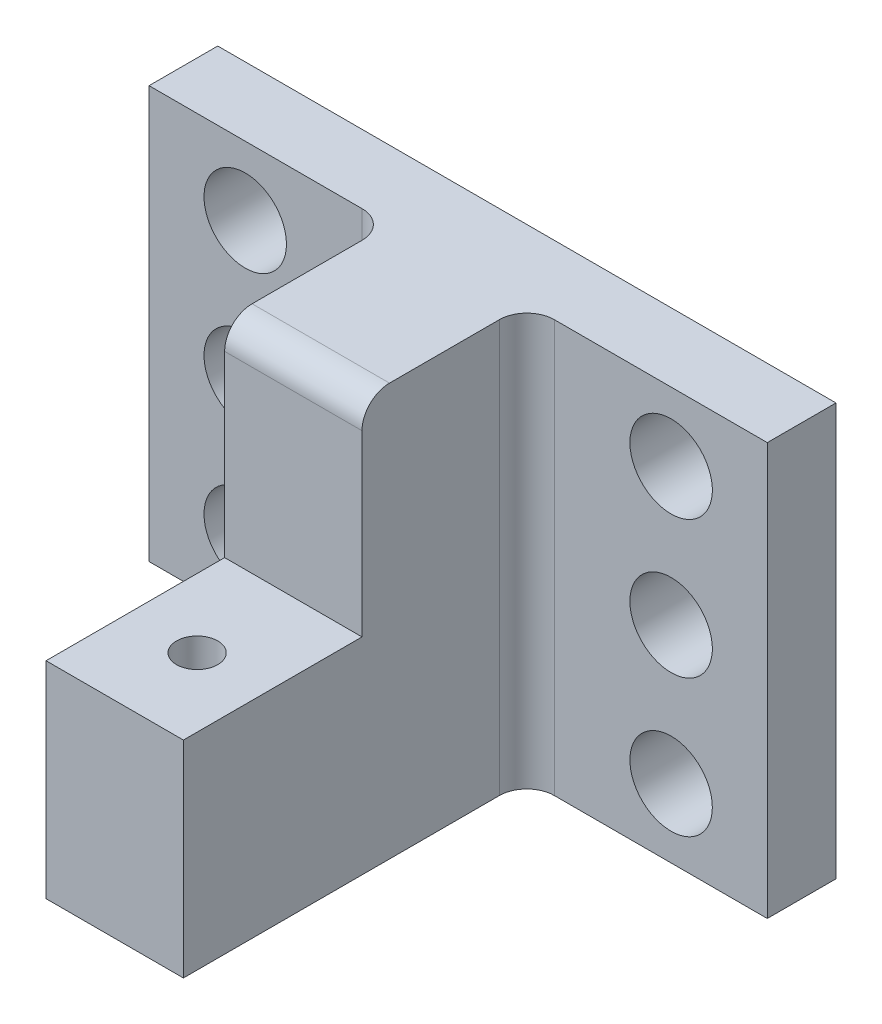
ISO-10303-21;
HEADER;
FILE_DESCRIPTION(('STEP AP214'),'2;1');
FILE_NAME('part.step','',(''),(''),'','','');
FILE_SCHEMA(('AUTOMOTIVE_DESIGN { 1 0 10303 214 1 1 1 1 }'));
ENDSEC;
DATA;
#1=APPLICATION_CONTEXT('core data for automotive mechanical design processes');
#2=APPLICATION_PROTOCOL_DEFINITION('international standard','automotive_design',2000,#1);
#3=PRODUCT_CONTEXT('',#1,'mechanical');
#4=PRODUCT('Part','Part','',(#3));
#5=PRODUCT_RELATED_PRODUCT_CATEGORY('part','',(#4));
#6=PRODUCT_DEFINITION_FORMATION('','',#4);
#7=PRODUCT_DEFINITION_CONTEXT('part definition',#1,'design');
#8=PRODUCT_DEFINITION('design','',#6,#7);
#9=PRODUCT_DEFINITION_SHAPE('','',#8);
#10=(LENGTH_UNIT() NAMED_UNIT(*) SI_UNIT(.MILLI.,.METRE.));
#11=(NAMED_UNIT(*) PLANE_ANGLE_UNIT() SI_UNIT($,.RADIAN.));
#12=(NAMED_UNIT(*) SI_UNIT($,.STERADIAN.) SOLID_ANGLE_UNIT());
#13=UNCERTAINTY_MEASURE_WITH_UNIT(LENGTH_MEASURE(1.E-05),#10,'distance_accuracy_value','');
#14=(GEOMETRIC_REPRESENTATION_CONTEXT(3) GLOBAL_UNCERTAINTY_ASSIGNED_CONTEXT((#13)) GLOBAL_UNIT_ASSIGNED_CONTEXT((#10,
#11,#12)) REPRESENTATION_CONTEXT('',''));
#15=CARTESIAN_POINT('',(0.,0.,0.));
#16=DIRECTION('',(0.,0.,1.));
#17=DIRECTION('',(1.,0.,0.));
#18=AXIS2_PLACEMENT_3D('',#15,#16,#17);
#19=CARTESIAN_POINT('',(7.,15.,7.));
#20=DIRECTION('',(0.,1.,0.));
#21=DIRECTION('',(-1.,0.,0.));
#22=AXIS2_PLACEMENT_3D('',#19,#20,#21);
#23=CYLINDRICAL_SURFACE('',#22,2.);
#24=DIRECTION('',(0.,1.,0.));
#25=VECTOR('',#24,1.);
#26=CARTESIAN_POINT('',(5.,15.,7.));
#27=LINE('',#26,#25);
#28=CARTESIAN_POINT('',(5.,-15.,7.));
#29=VERTEX_POINT('',#28);
#30=CARTESIAN_POINT('',(5.,15.,7.));
#31=VERTEX_POINT('',#30);
#32=EDGE_CURVE('E319',#29,#31,#27,.T.);
#33=ORIENTED_EDGE('',*,*,#32,.F.);
#34=CARTESIAN_POINT('',(7.,-15.,7.));
#35=DIRECTION('',(0.,1.,0.));
#36=DIRECTION('',(0.,0.,1.));
#37=AXIS2_PLACEMENT_3D('',#34,#35,#36);
#38=CIRCLE('',#37,2.);
#39=CARTESIAN_POINT('',(7.,-15.,5.));
#40=VERTEX_POINT('',#39);
#41=EDGE_CURVE('E45',#29,#40,#38,.F.);
#42=ORIENTED_EDGE('',*,*,#41,.T.);
#43=DIRECTION('',(0.,1.,0.));
#44=VECTOR('',#43,1.);
#45=CARTESIAN_POINT('',(7.,0.,5.));
#46=LINE('',#45,#44);
#47=CARTESIAN_POINT('',(6.99999999999999,15.,5.));
#48=VERTEX_POINT('',#47);
#49=EDGE_CURVE('E323',#48,#40,#46,.F.);
#50=ORIENTED_EDGE('',*,*,#49,.F.);
#51=CARTESIAN_POINT('',(7.,15.,7.));
#52=DIRECTION('',(0.,-1.,0.));
#53=DIRECTION('',(0.,0.,-1.));
#54=AXIS2_PLACEMENT_3D('',#51,#52,#53);
#55=CIRCLE('',#54,2.);
#56=EDGE_CURVE('E11',#48,#31,#55,.F.);
#57=ORIENTED_EDGE('',*,*,#56,.T.);
#58=EDGE_LOOP('',(#33,#42,#50,#57));
#59=FACE_BOUND('',#58,.T.);
#60=ADVANCED_FACE('F37',(#59),#23,.F.);
#61=CARTESIAN_POINT('',(-7.,15.,7.));
#62=DIRECTION('',(0.,-1.,0.));
#63=DIRECTION('',(1.,0.,0.));
#64=AXIS2_PLACEMENT_3D('',#61,#62,#63);
#65=CYLINDRICAL_SURFACE('',#64,2.);
#66=DIRECTION('',(0.,-1.,0.));
#67=VECTOR('',#66,1.);
#68=CARTESIAN_POINT('',(-5.,15.,7.));
#69=LINE('',#68,#67);
#70=CARTESIAN_POINT('',(-5.,15.,7.));
#71=VERTEX_POINT('',#70);
#72=CARTESIAN_POINT('',(-5.,-15.,7.));
#73=VERTEX_POINT('',#72);
#74=EDGE_CURVE('E305',#71,#73,#69,.T.);
#75=ORIENTED_EDGE('',*,*,#74,.F.);
#76=CARTESIAN_POINT('',(-7.,15.,7.));
#77=DIRECTION('',(0.,-1.,0.));
#78=DIRECTION('',(0.,0.,-1.));
#79=AXIS2_PLACEMENT_3D('',#76,#77,#78);
#80=CIRCLE('',#79,2.);
#81=CARTESIAN_POINT('',(-7.00000000000001,15.,5.));
#82=VERTEX_POINT('',#81);
#83=EDGE_CURVE('E313',#71,#82,#80,.F.);
#84=ORIENTED_EDGE('',*,*,#83,.T.);
#85=DIRECTION('',(0.,-1.,0.));
#86=VECTOR('',#85,1.);
#87=CARTESIAN_POINT('',(-7.,0.,5.));
#88=LINE('',#87,#86);
#89=CARTESIAN_POINT('',(-7.,-15.,5.));
#90=VERTEX_POINT('',#89);
#91=EDGE_CURVE('E309',#90,#82,#88,.F.);
#92=ORIENTED_EDGE('',*,*,#91,.F.);
#93=CARTESIAN_POINT('',(-7.,-15.,7.));
#94=DIRECTION('',(0.,1.,0.));
#95=DIRECTION('',(0.,0.,1.));
#96=AXIS2_PLACEMENT_3D('',#93,#94,#95);
#97=CIRCLE('',#96,2.);
#98=EDGE_CURVE('E316',#90,#73,#97,.F.);
#99=ORIENTED_EDGE('',*,*,#98,.T.);
#100=EDGE_LOOP('',(#75,#84,#92,#99));
#101=FACE_BOUND('',#100,.T.);
#102=ADVANCED_FACE('F404',(#101),#65,.F.);
#103=CARTESIAN_POINT('',(4.99999999999999,13.,15.));
#104=DIRECTION('',(-1.,0.,0.));
#105=DIRECTION('',(0.,0.,1.));
#106=AXIS2_PLACEMENT_3D('',#103,#104,#105);
#107=CYLINDRICAL_SURFACE('',#106,2.);
#108=DIRECTION('',(-1.,0.,0.));
#109=VECTOR('',#108,1.);
#110=CARTESIAN_POINT('',(4.99999999999999,13.,17.));
#111=LINE('',#110,#109);
#112=CARTESIAN_POINT('',(5.,13.,17.));
#113=VERTEX_POINT('',#112);
#114=CARTESIAN_POINT('',(-5.,13.,17.));
#115=VERTEX_POINT('',#114);
#116=EDGE_CURVE('E293',#113,#115,#111,.T.);
#117=ORIENTED_EDGE('',*,*,#116,.F.);
#118=CARTESIAN_POINT('',(5.,13.,15.));
#119=DIRECTION('',(-1.,0.,0.));
#120=DIRECTION('',(0.,-1.,0.));
#121=AXIS2_PLACEMENT_3D('',#118,#119,#120);
#122=CIRCLE('',#121,2.);
#123=CARTESIAN_POINT('',(5.,15.,15.));
#124=VERTEX_POINT('',#123);
#125=EDGE_CURVE('E139',#124,#113,#122,.F.);
#126=ORIENTED_EDGE('',*,*,#125,.F.);
#127=DIRECTION('',(-1.,0.,0.));
#128=VECTOR('',#127,1.);
#129=CARTESIAN_POINT('',(-22.5,15.,15.));
#130=LINE('',#129,#128);
#131=CARTESIAN_POINT('',(-5.,15.,15.));
#132=VERTEX_POINT('',#131);
#133=EDGE_CURVE('E296',#132,#124,#130,.F.);
#134=ORIENTED_EDGE('',*,*,#133,.F.);
#135=CARTESIAN_POINT('',(-5.,13.,15.));
#136=DIRECTION('',(1.,0.,0.));
#137=DIRECTION('',(0.,1.,0.));
#138=AXIS2_PLACEMENT_3D('',#135,#136,#137);
#139=CIRCLE('',#138,2.);
#140=EDGE_CURVE('E302',#115,#132,#139,.F.);
#141=ORIENTED_EDGE('',*,*,#140,.F.);
#142=EDGE_LOOP('',(#117,#126,#134,#141));
#143=FACE_BOUND('',#142,.T.);
#144=ADVANCED_FACE('F408',(#143),#107,.T.);
#145=CARTESIAN_POINT('',(0.,0.,5.));
#146=DIRECTION('',(0.,0.,1.));
#147=DIRECTION('',(1.,0.,0.));
#148=AXIS2_PLACEMENT_3D('',#145,#146,#147);
#149=PLANE('',#148);
#150=CARTESIAN_POINT('',(-15.5,0.,5.));
#151=DIRECTION('',(0.,0.,1.));
#152=DIRECTION('',(1.,0.,0.));
#153=AXIS2_PLACEMENT_3D('',#150,#151,#152);
#154=CIRCLE('',#153,3.);
#155=CARTESIAN_POINT('',(-12.5,0.,5.));
#156=VERTEX_POINT('',#155);
#157=EDGE_CURVE('E181',#156,#156,#154,.T.);
#158=ORIENTED_EDGE('',*,*,#157,.F.);
#159=EDGE_LOOP('',(#158));
#160=FACE_BOUND('',#159,.T.);
#161=CARTESIAN_POINT('',(-15.5,10.,5.));
#162=DIRECTION('',(0.,0.,1.));
#163=DIRECTION('',(1.,0.,0.));
#164=AXIS2_PLACEMENT_3D('',#161,#162,#163);
#165=CIRCLE('',#164,3.);
#166=CARTESIAN_POINT('',(-12.5,10.,5.));
#167=VERTEX_POINT('',#166);
#168=EDGE_CURVE('E180',#167,#167,#165,.T.);
#169=ORIENTED_EDGE('',*,*,#168,.F.);
#170=EDGE_LOOP('',(#169));
#171=FACE_BOUND('',#170,.T.);
#172=CARTESIAN_POINT('',(-15.5,-10.,5.));
#173=DIRECTION('',(0.,0.,1.));
#174=DIRECTION('',(-1.,0.,0.));
#175=AXIS2_PLACEMENT_3D('',#172,#173,#174);
#176=CIRCLE('',#175,2.99999999999998);
#177=CARTESIAN_POINT('',(-18.5,-10.,5.));
#178=VERTEX_POINT('',#177);
#179=EDGE_CURVE('E197',#178,#178,#176,.T.);
#180=ORIENTED_EDGE('',*,*,#179,.F.);
#181=EDGE_LOOP('',(#180));
#182=FACE_BOUND('',#181,.T.);
#183=DIRECTION('',(1.,0.,0.));
#184=VECTOR('',#183,1.);
#185=CARTESIAN_POINT('',(-22.5,-15.,5.));
#186=LINE('',#185,#184);
#187=CARTESIAN_POINT('',(-22.5,-15.,5.));
#188=VERTEX_POINT('',#187);
#189=EDGE_CURVE('E252',#188,#90,#186,.T.);
#190=ORIENTED_EDGE('',*,*,#189,.T.);
#191=ORIENTED_EDGE('',*,*,#91,.T.);
#192=DIRECTION('',(-1.,0.,0.));
#193=VECTOR('',#192,1.);
#194=CARTESIAN_POINT('',(-22.5,15.,5.));
#195=LINE('',#194,#193);
#196=CARTESIAN_POINT('',(-22.5,15.,5.));
#197=VERTEX_POINT('',#196);
#198=EDGE_CURVE('E259',#82,#197,#195,.T.);
#199=ORIENTED_EDGE('',*,*,#198,.T.);
#200=DIRECTION('',(0.,-1.,0.));
#201=VECTOR('',#200,1.);
#202=CARTESIAN_POINT('',(-22.5,15.,5.));
#203=LINE('',#202,#201);
#204=EDGE_CURVE('E246',#197,#188,#203,.T.);
#205=ORIENTED_EDGE('',*,*,#204,.T.);
#206=EDGE_LOOP('',(#190,#191,#199,#205));
#207=FACE_BOUND('',#206,.T.);
#208=ADVANCED_FACE('F400',(#160,#171,#182,#207),#149,.T.);
#209=CARTESIAN_POINT('',(-22.5,15.,5.));
#210=DIRECTION('',(1.,0.,0.));
#211=DIRECTION('',(0.,1.,0.));
#212=AXIS2_PLACEMENT_3D('',#209,#210,#211);
#213=PLANE('',#212);
#214=DIRECTION('',(0.,-1.,0.));
#215=VECTOR('',#214,1.);
#216=CARTESIAN_POINT('',(-22.5,15.,0.));
#217=LINE('',#216,#215);
#218=CARTESIAN_POINT('',(-22.5,15.,0.));
#219=VERTEX_POINT('',#218);
#220=CARTESIAN_POINT('',(-22.5,-15.,0.));
#221=VERTEX_POINT('',#220);
#222=EDGE_CURVE('E245',#219,#221,#217,.T.);
#223=ORIENTED_EDGE('',*,*,#222,.T.);
#224=DIRECTION('',(0.,0.,-1.));
#225=VECTOR('',#224,1.);
#226=CARTESIAN_POINT('',(-22.5,-15.,5.));
#227=LINE('',#226,#225);
#228=EDGE_CURVE('E287',#188,#221,#227,.T.);
#229=ORIENTED_EDGE('',*,*,#228,.F.);
#230=ORIENTED_EDGE('',*,*,#204,.F.);
#231=DIRECTION('',(0.,0.,-1.));
#232=VECTOR('',#231,1.);
#233=CARTESIAN_POINT('',(-22.5,15.,5.));
#234=LINE('',#233,#232);
#235=EDGE_CURVE('E264',#197,#219,#234,.T.);
#236=ORIENTED_EDGE('',*,*,#235,.T.);
#237=EDGE_LOOP('',(#223,#229,#230,#236));
#238=FACE_BOUND('',#237,.T.);
#239=ADVANCED_FACE('F425',(#238),#213,.F.);
#240=CARTESIAN_POINT('',(-22.5,-15.,5.));
#241=DIRECTION('',(0.,1.,0.));
#242=DIRECTION('',(0.,0.,1.));
#243=AXIS2_PLACEMENT_3D('',#240,#241,#242);
#244=PLANE('',#243);
#245=CARTESIAN_POINT('',(0.,-15.,24.));
#246=DIRECTION('',(0.,-1.,0.));
#247=DIRECTION('',(0.,0.,-1.));
#248=AXIS2_PLACEMENT_3D('',#245,#246,#247);
#249=CIRCLE('',#248,1.5);
#250=CARTESIAN_POINT('',(0.,-15.,22.5));
#251=VERTEX_POINT('',#250);
#252=EDGE_CURVE('E212',#251,#251,#249,.T.);
#253=ORIENTED_EDGE('',*,*,#252,.F.);
#254=EDGE_LOOP('',(#253));
#255=FACE_BOUND('',#254,.T.);
#256=DIRECTION('',(1.,0.,0.));
#257=VECTOR('',#256,1.);
#258=CARTESIAN_POINT('',(-22.5,-15.,0.));
#259=LINE('',#258,#257);
#260=CARTESIAN_POINT('',(22.5,-15.,0.));
#261=VERTEX_POINT('',#260);
#262=EDGE_CURVE('E268',#221,#261,#259,.T.);
#263=ORIENTED_EDGE('',*,*,#262,.T.);
#264=DIRECTION('',(0.,0.,-1.));
#265=VECTOR('',#264,1.);
#266=CARTESIAN_POINT('',(22.5,-15.,5.));
#267=LINE('',#266,#265);
#268=CARTESIAN_POINT('',(22.5,-15.,5.));
#269=VERTEX_POINT('',#268);
#270=EDGE_CURVE('E283',#269,#261,#267,.T.);
#271=ORIENTED_EDGE('',*,*,#270,.F.);
#272=EDGE_CURVE('E250',#40,#269,#186,.T.);
#273=ORIENTED_EDGE('',*,*,#272,.F.);
#274=ORIENTED_EDGE('',*,*,#41,.F.);
#275=DIRECTION('',(0.,0.,-1.));
#276=VECTOR('',#275,1.);
#277=CARTESIAN_POINT('',(5.,-15.,30.));
#278=LINE('',#277,#276);
#279=CARTESIAN_POINT('',(5.,-15.,30.));
#280=VERTEX_POINT('',#279);
#281=EDGE_CURVE('E238',#280,#29,#278,.T.);
#282=ORIENTED_EDGE('',*,*,#281,.F.);
#283=DIRECTION('',(1.,0.,0.));
#284=VECTOR('',#283,1.);
#285=CARTESIAN_POINT('',(-5.,-15.,30.));
#286=LINE('',#285,#284);
#287=CARTESIAN_POINT('',(-5.,-15.,30.));
#288=VERTEX_POINT('',#287);
#289=EDGE_CURVE('E225',#288,#280,#286,.T.);
#290=ORIENTED_EDGE('',*,*,#289,.F.);
#291=DIRECTION('',(0.,0.,-1.));
#292=VECTOR('',#291,1.);
#293=CARTESIAN_POINT('',(-5.,-15.,30.));
#294=LINE('',#293,#292);
#295=EDGE_CURVE('E241',#288,#73,#294,.T.);
#296=ORIENTED_EDGE('',*,*,#295,.T.);
#297=ORIENTED_EDGE('',*,*,#98,.F.);
#298=ORIENTED_EDGE('',*,*,#189,.F.);
#299=ORIENTED_EDGE('',*,*,#228,.T.);
#300=EDGE_LOOP('',(#263,#271,#273,#274,#282,#290,#296,#297,#298,#299));
#301=FACE_BOUND('',#300,.T.);
#302=ADVANCED_FACE('F384',(#255,#301),#244,.F.);
#303=CARTESIAN_POINT('',(22.5,15.,5.));
#304=DIRECTION('',(-1.,0.,0.));
#305=DIRECTION('',(0.,-1.,0.));
#306=AXIS2_PLACEMENT_3D('',#303,#304,#305);
#307=PLANE('',#306);
#308=DIRECTION('',(0.,1.,0.));
#309=VECTOR('',#308,1.);
#310=CARTESIAN_POINT('',(22.5,15.,0.));
#311=LINE('',#310,#309);
#312=CARTESIAN_POINT('',(22.5,15.,0.));
#313=VERTEX_POINT('',#312);
#314=EDGE_CURVE('E271',#261,#313,#311,.T.);
#315=ORIENTED_EDGE('',*,*,#314,.T.);
#316=DIRECTION('',(0.,0.,-1.));
#317=VECTOR('',#316,1.);
#318=CARTESIAN_POINT('',(22.5,15.,5.));
#319=LINE('',#318,#317);
#320=CARTESIAN_POINT('',(22.5,15.,5.));
#321=VERTEX_POINT('',#320);
#322=EDGE_CURVE('E279',#321,#313,#319,.T.);
#323=ORIENTED_EDGE('',*,*,#322,.F.);
#324=DIRECTION('',(0.,1.,0.));
#325=VECTOR('',#324,1.);
#326=CARTESIAN_POINT('',(22.5,15.,5.));
#327=LINE('',#326,#325);
#328=EDGE_CURVE('E256',#269,#321,#327,.T.);
#329=ORIENTED_EDGE('',*,*,#328,.F.);
#330=ORIENTED_EDGE('',*,*,#270,.T.);
#331=EDGE_LOOP('',(#315,#323,#329,#330));
#332=FACE_BOUND('',#331,.T.);
#333=ADVANCED_FACE('F387',(#332),#307,.F.);
#334=CARTESIAN_POINT('',(-22.5,15.,5.));
#335=DIRECTION('',(0.,-1.,0.));
#336=DIRECTION('',(0.,0.,-1.));
#337=AXIS2_PLACEMENT_3D('',#334,#335,#336);
#338=PLANE('',#337);
#339=DIRECTION('',(0.,0.,-1.));
#340=VECTOR('',#339,1.);
#341=CARTESIAN_POINT('',(-5.,15.,30.));
#342=LINE('',#341,#340);
#343=EDGE_CURVE('E231',#132,#71,#342,.T.);
#344=ORIENTED_EDGE('',*,*,#343,.F.);
#345=ORIENTED_EDGE('',*,*,#133,.T.);
#346=DIRECTION('',(0.,0.,-1.));
#347=VECTOR('',#346,1.);
#348=CARTESIAN_POINT('',(5.,15.,30.));
#349=LINE('',#348,#347);
#350=EDGE_CURVE('E235',#124,#31,#349,.T.);
#351=ORIENTED_EDGE('',*,*,#350,.T.);
#352=ORIENTED_EDGE('',*,*,#56,.F.);
#353=EDGE_CURVE('E260',#321,#48,#195,.T.);
#354=ORIENTED_EDGE('',*,*,#353,.F.);
#355=ORIENTED_EDGE('',*,*,#322,.T.);
#356=DIRECTION('',(-1.,0.,0.));
#357=VECTOR('',#356,1.);
#358=CARTESIAN_POINT('',(-22.5,15.,0.));
#359=LINE('',#358,#357);
#360=EDGE_CURVE('E251',#313,#219,#359,.T.);
#361=ORIENTED_EDGE('',*,*,#360,.T.);
#362=ORIENTED_EDGE('',*,*,#235,.F.);
#363=ORIENTED_EDGE('',*,*,#198,.F.);
#364=ORIENTED_EDGE('',*,*,#83,.F.);
#365=EDGE_LOOP('',(#344,#345,#351,#352,#354,#355,#361,#362,#363,#364));
#366=FACE_BOUND('',#365,.T.);
#367=ADVANCED_FACE('F390',(#366),#338,.F.);
#368=CARTESIAN_POINT('',(15.5,0.,5.));
#369=DIRECTION('',(0.,0.,1.));
#370=DIRECTION('',(-1.,0.,0.));
#371=AXIS2_PLACEMENT_3D('',#368,#369,#370);
#372=CIRCLE('',#371,3.);
#373=CARTESIAN_POINT('',(12.5,0.,5.));
#374=VERTEX_POINT('',#373);
#375=EDGE_CURVE('E171',#374,#374,#372,.T.);
#376=ORIENTED_EDGE('',*,*,#375,.F.);
#377=EDGE_LOOP('',(#376));
#378=FACE_BOUND('',#377,.T.);
#379=CARTESIAN_POINT('',(15.5,10.,5.));
#380=DIRECTION('',(0.,0.,1.));
#381=DIRECTION('',(-1.,0.,0.));
#382=AXIS2_PLACEMENT_3D('',#379,#380,#381);
#383=CIRCLE('',#382,3.);
#384=CARTESIAN_POINT('',(12.5,10.,5.));
#385=VERTEX_POINT('',#384);
#386=EDGE_CURVE('E172',#385,#385,#383,.T.);
#387=ORIENTED_EDGE('',*,*,#386,.F.);
#388=EDGE_LOOP('',(#387));
#389=FACE_BOUND('',#388,.T.);
#390=CARTESIAN_POINT('',(15.5,-9.99999999999999,5.));
#391=DIRECTION('',(0.,0.,1.));
#392=DIRECTION('',(1.,0.,0.));
#393=AXIS2_PLACEMENT_3D('',#390,#391,#392);
#394=CIRCLE('',#393,2.99999999999998);
#395=CARTESIAN_POINT('',(18.5,-9.99999999999999,5.));
#396=VERTEX_POINT('',#395);
#397=EDGE_CURVE('E196',#396,#396,#394,.T.);
#398=ORIENTED_EDGE('',*,*,#397,.F.);
#399=EDGE_LOOP('',(#398));
#400=FACE_BOUND('',#399,.T.);
#401=ORIENTED_EDGE('',*,*,#353,.T.);
#402=ORIENTED_EDGE('',*,*,#49,.T.);
#403=ORIENTED_EDGE('',*,*,#272,.T.);
#404=ORIENTED_EDGE('',*,*,#328,.T.);
#405=EDGE_LOOP('',(#401,#402,#403,#404));
#406=FACE_BOUND('',#405,.T.);
#407=ADVANCED_FACE('F380',(#378,#389,#400,#406),#149,.T.);
#408=CARTESIAN_POINT('',(0.,0.,0.));
#409=DIRECTION('',(0.,0.,1.));
#410=DIRECTION('',(1.,0.,0.));
#411=AXIS2_PLACEMENT_3D('',#408,#409,#410);
#412=PLANE('',#411);
#413=CARTESIAN_POINT('',(15.5,0.,0.));
#414=DIRECTION('',(0.,0.,1.));
#415=DIRECTION('',(-1.,0.,0.));
#416=AXIS2_PLACEMENT_3D('',#413,#414,#415);
#417=CIRCLE('',#416,3.);
#418=CARTESIAN_POINT('',(12.5,0.,0.));
#419=VERTEX_POINT('',#418);
#420=EDGE_CURVE('E185',#419,#419,#417,.T.);
#421=ORIENTED_EDGE('',*,*,#420,.T.);
#422=EDGE_LOOP('',(#421));
#423=FACE_BOUND('',#422,.T.);
#424=CARTESIAN_POINT('',(-15.5,0.,0.));
#425=DIRECTION('',(0.,0.,1.));
#426=DIRECTION('',(1.,0.,0.));
#427=AXIS2_PLACEMENT_3D('',#424,#425,#426);
#428=CIRCLE('',#427,3.);
#429=CARTESIAN_POINT('',(-12.5,0.,0.));
#430=VERTEX_POINT('',#429);
#431=EDGE_CURVE('E176',#430,#430,#428,.T.);
#432=ORIENTED_EDGE('',*,*,#431,.T.);
#433=EDGE_LOOP('',(#432));
#434=FACE_BOUND('',#433,.T.);
#435=CARTESIAN_POINT('',(-15.5,10.,0.));
#436=DIRECTION('',(0.,0.,1.));
#437=DIRECTION('',(1.,0.,0.));
#438=AXIS2_PLACEMENT_3D('',#435,#436,#437);
#439=CIRCLE('',#438,3.);
#440=CARTESIAN_POINT('',(-12.5,10.,0.));
#441=VERTEX_POINT('',#440);
#442=EDGE_CURVE('E201',#441,#441,#439,.T.);
#443=ORIENTED_EDGE('',*,*,#442,.T.);
#444=EDGE_LOOP('',(#443));
#445=FACE_BOUND('',#444,.T.);
#446=CARTESIAN_POINT('',(-15.5,-10.,0.));
#447=DIRECTION('',(0.,0.,1.));
#448=DIRECTION('',(-1.,0.,0.));
#449=AXIS2_PLACEMENT_3D('',#446,#447,#448);
#450=CIRCLE('',#449,2.99999999999998);
#451=CARTESIAN_POINT('',(-18.5,-10.,0.));
#452=VERTEX_POINT('',#451);
#453=EDGE_CURVE('E192',#452,#452,#450,.T.);
#454=ORIENTED_EDGE('',*,*,#453,.T.);
#455=EDGE_LOOP('',(#454));
#456=FACE_BOUND('',#455,.T.);
#457=CARTESIAN_POINT('',(15.5,10.,0.));
#458=DIRECTION('',(0.,0.,1.));
#459=DIRECTION('',(-1.,0.,0.));
#460=AXIS2_PLACEMENT_3D('',#457,#458,#459);
#461=CIRCLE('',#460,3.);
#462=CARTESIAN_POINT('',(12.5,10.,0.));
#463=VERTEX_POINT('',#462);
#464=EDGE_CURVE('E167',#463,#463,#461,.T.);
#465=ORIENTED_EDGE('',*,*,#464,.T.);
#466=EDGE_LOOP('',(#465));
#467=FACE_BOUND('',#466,.T.);
#468=CARTESIAN_POINT('',(15.5,-9.99999999999999,0.));
#469=DIRECTION('',(0.,0.,1.));
#470=DIRECTION('',(1.,0.,0.));
#471=AXIS2_PLACEMENT_3D('',#468,#469,#470);
#472=CIRCLE('',#471,2.99999999999998);
#473=CARTESIAN_POINT('',(18.5,-9.99999999999999,0.));
#474=VERTEX_POINT('',#473);
#475=EDGE_CURVE('E208',#474,#474,#472,.T.);
#476=ORIENTED_EDGE('',*,*,#475,.T.);
#477=EDGE_LOOP('',(#476));
#478=FACE_BOUND('',#477,.T.);
#479=ORIENTED_EDGE('',*,*,#222,.F.);
#480=ORIENTED_EDGE('',*,*,#360,.F.);
#481=ORIENTED_EDGE('',*,*,#314,.F.);
#482=ORIENTED_EDGE('',*,*,#262,.F.);
#483=EDGE_LOOP('',(#479,#480,#481,#482));
#484=FACE_BOUND('',#483,.T.);
#485=ADVANCED_FACE('F397',(#423,#434,#445,#456,#467,#478,#484),#412,.F.);
#486=CARTESIAN_POINT('',(-5.,15.,30.));
#487=DIRECTION('',(1.,0.,0.));
#488=DIRECTION('',(0.,1.,0.));
#489=AXIS2_PLACEMENT_3D('',#486,#487,#488);
#490=PLANE('',#489);
#491=ORIENTED_EDGE('',*,*,#343,.T.);
#492=ORIENTED_EDGE('',*,*,#74,.T.);
#493=ORIENTED_EDGE('',*,*,#295,.F.);
#494=DIRECTION('',(0.,-1.,0.));
#495=VECTOR('',#494,1.);
#496=CARTESIAN_POINT('',(-5.,15.,30.));
#497=LINE('',#496,#495);
#498=CARTESIAN_POINT('',(-5.,0.,30.));
#499=VERTEX_POINT('',#498);
#500=EDGE_CURVE('E222',#499,#288,#497,.T.);
#501=ORIENTED_EDGE('',*,*,#500,.F.);
#502=DIRECTION('',(0.,0.,1.));
#503=VECTOR('',#502,1.);
#504=CARTESIAN_POINT('',(-5.,0.,17.));
#505=LINE('',#504,#503);
#506=CARTESIAN_POINT('',(-5.,0.,17.));
#507=VERTEX_POINT('',#506);
#508=EDGE_CURVE('E144',#507,#499,#505,.T.);
#509=ORIENTED_EDGE('',*,*,#508,.F.);
#510=DIRECTION('',(0.,-1.,0.));
#511=VECTOR('',#510,1.);
#512=CARTESIAN_POINT('',(-5.00000000000001,20.,17.));
#513=LINE('',#512,#511);
#514=EDGE_CURVE('E150',#115,#507,#513,.T.);
#515=ORIENTED_EDGE('',*,*,#514,.F.);
#516=ORIENTED_EDGE('',*,*,#140,.T.);
#517=EDGE_LOOP('',(#491,#492,#493,#501,#509,#515,#516));
#518=FACE_BOUND('',#517,.T.);
#519=ADVANCED_FACE('F416',(#518),#490,.F.);
#520=CARTESIAN_POINT('',(5.,15.,30.));
#521=DIRECTION('',(-1.,0.,0.));
#522=DIRECTION('',(0.,-1.,0.));
#523=AXIS2_PLACEMENT_3D('',#520,#521,#522);
#524=PLANE('',#523);
#525=ORIENTED_EDGE('',*,*,#281,.T.);
#526=ORIENTED_EDGE('',*,*,#32,.T.);
#527=ORIENTED_EDGE('',*,*,#350,.F.);
#528=ORIENTED_EDGE('',*,*,#125,.T.);
#529=DIRECTION('',(0.,-1.,0.));
#530=VECTOR('',#529,1.);
#531=CARTESIAN_POINT('',(4.99999999999999,20.,17.));
#532=LINE('',#531,#530);
#533=CARTESIAN_POINT('',(5.,0.,17.));
#534=VERTEX_POINT('',#533);
#535=EDGE_CURVE('E130',#113,#534,#532,.T.);
#536=ORIENTED_EDGE('',*,*,#535,.T.);
#537=DIRECTION('',(0.,0.,1.));
#538=VECTOR('',#537,1.);
#539=CARTESIAN_POINT('',(5.,0.,17.));
#540=LINE('',#539,#538);
#541=CARTESIAN_POINT('',(5.,0.,30.));
#542=VERTEX_POINT('',#541);
#543=EDGE_CURVE('E136',#534,#542,#540,.T.);
#544=ORIENTED_EDGE('',*,*,#543,.T.);
#545=DIRECTION('',(0.,1.,0.));
#546=VECTOR('',#545,1.);
#547=CARTESIAN_POINT('',(5.,15.,30.));
#548=LINE('',#547,#546);
#549=EDGE_CURVE('E228',#280,#542,#548,.T.);
#550=ORIENTED_EDGE('',*,*,#549,.F.);
#551=EDGE_LOOP('',(#525,#526,#527,#528,#536,#544,#550));
#552=FACE_BOUND('',#551,.T.);
#553=ADVANCED_FACE('F133',(#552),#524,.F.);
#554=CARTESIAN_POINT('',(0.,0.,30.));
#555=DIRECTION('',(0.,0.,1.));
#556=DIRECTION('',(1.,0.,0.));
#557=AXIS2_PLACEMENT_3D('',#554,#555,#556);
#558=PLANE('',#557);
#559=DIRECTION('',(1.,0.,0.));
#560=VECTOR('',#559,1.);
#561=CARTESIAN_POINT('',(0.,0.,30.));
#562=LINE('',#561,#560);
#563=EDGE_CURVE('E158',#499,#542,#562,.T.);
#564=ORIENTED_EDGE('',*,*,#563,.F.);
#565=ORIENTED_EDGE('',*,*,#500,.T.);
#566=ORIENTED_EDGE('',*,*,#289,.T.);
#567=ORIENTED_EDGE('',*,*,#549,.T.);
#568=EDGE_LOOP('',(#564,#565,#566,#567));
#569=FACE_BOUND('',#568,.T.);
#570=ADVANCED_FACE('F438',(#569),#558,.T.);
#571=CARTESIAN_POINT('',(0.,0.,24.));
#572=DIRECTION('',(0.,-1.,0.));
#573=DIRECTION('',(0.,0.,-1.));
#574=AXIS2_PLACEMENT_3D('',#571,#572,#573);
#575=CYLINDRICAL_SURFACE('',#574,1.5);
#576=CARTESIAN_POINT('',(0.,0.,24.));
#577=DIRECTION('',(0.,-1.,0.));
#578=DIRECTION('',(0.,0.,-1.));
#579=AXIS2_PLACEMENT_3D('',#576,#577,#578);
#580=CIRCLE('',#579,1.5);
#581=CARTESIAN_POINT('',(0.,0.,22.5));
#582=VERTEX_POINT('',#581);
#583=EDGE_CURVE('E154',#582,#582,#580,.T.);
#584=ORIENTED_EDGE('',*,*,#583,.F.);
#585=EDGE_LOOP('',(#584));
#586=FACE_BOUND('',#585,.T.);
#587=ORIENTED_EDGE('',*,*,#252,.T.);
#588=EDGE_LOOP('',(#587));
#589=FACE_BOUND('',#588,.T.);
#590=ADVANCED_FACE('F441',(#586,#589),#575,.F.);
#591=CARTESIAN_POINT('',(15.5,-9.99999999999999,0.));
#592=DIRECTION('',(0.,0.,1.));
#593=DIRECTION('',(1.,0.,0.));
#594=AXIS2_PLACEMENT_3D('',#591,#592,#593);
#595=CYLINDRICAL_SURFACE('',#594,2.99999999999998);
#596=ORIENTED_EDGE('',*,*,#475,.F.);
#597=EDGE_LOOP('',(#596));
#598=FACE_BOUND('',#597,.T.);
#599=ORIENTED_EDGE('',*,*,#397,.T.);
#600=EDGE_LOOP('',(#599));
#601=FACE_BOUND('',#600,.T.);
#602=ADVANCED_FACE('F444',(#598,#601),#595,.F.);
#603=CARTESIAN_POINT('',(15.5,10.,0.));
#604=DIRECTION('',(0.,0.,1.));
#605=DIRECTION('',(1.,0.,0.));
#606=AXIS2_PLACEMENT_3D('',#603,#604,#605);
#607=CYLINDRICAL_SURFACE('',#606,3.);
#608=ORIENTED_EDGE('',*,*,#464,.F.);
#609=EDGE_LOOP('',(#608));
#610=FACE_BOUND('',#609,.T.);
#611=ORIENTED_EDGE('',*,*,#386,.T.);
#612=EDGE_LOOP('',(#611));
#613=FACE_BOUND('',#612,.T.);
#614=ADVANCED_FACE('F448',(#610,#613),#607,.F.);
#615=CARTESIAN_POINT('',(-15.5,-10.,0.));
#616=DIRECTION('',(0.,0.,1.));
#617=DIRECTION('',(1.,0.,0.));
#618=AXIS2_PLACEMENT_3D('',#615,#616,#617);
#619=CYLINDRICAL_SURFACE('',#618,2.99999999999998);
#620=ORIENTED_EDGE('',*,*,#453,.F.);
#621=EDGE_LOOP('',(#620));
#622=FACE_BOUND('',#621,.T.);
#623=ORIENTED_EDGE('',*,*,#179,.T.);
#624=EDGE_LOOP('',(#623));
#625=FACE_BOUND('',#624,.T.);
#626=ADVANCED_FACE('F454',(#622,#625),#619,.F.);
#627=CARTESIAN_POINT('',(-15.5,10.,0.));
#628=DIRECTION('',(0.,0.,1.));
#629=DIRECTION('',(1.,0.,0.));
#630=AXIS2_PLACEMENT_3D('',#627,#628,#629);
#631=CYLINDRICAL_SURFACE('',#630,3.);
#632=ORIENTED_EDGE('',*,*,#442,.F.);
#633=EDGE_LOOP('',(#632));
#634=FACE_BOUND('',#633,.T.);
#635=ORIENTED_EDGE('',*,*,#168,.T.);
#636=EDGE_LOOP('',(#635));
#637=FACE_BOUND('',#636,.T.);
#638=ADVANCED_FACE('F450',(#634,#637),#631,.F.);
#639=CARTESIAN_POINT('',(-15.5,0.,0.));
#640=DIRECTION('',(0.,0.,1.));
#641=DIRECTION('',(1.,0.,0.));
#642=AXIS2_PLACEMENT_3D('',#639,#640,#641);
#643=CYLINDRICAL_SURFACE('',#642,3.);
#644=ORIENTED_EDGE('',*,*,#431,.F.);
#645=EDGE_LOOP('',(#644));
#646=FACE_BOUND('',#645,.T.);
#647=ORIENTED_EDGE('',*,*,#157,.T.);
#648=EDGE_LOOP('',(#647));
#649=FACE_BOUND('',#648,.T.);
#650=ADVANCED_FACE('F453',(#646,#649),#643,.F.);
#651=CARTESIAN_POINT('',(15.5,0.,0.));
#652=DIRECTION('',(0.,0.,1.));
#653=DIRECTION('',(1.,0.,0.));
#654=AXIS2_PLACEMENT_3D('',#651,#652,#653);
#655=CYLINDRICAL_SURFACE('',#654,3.);
#656=ORIENTED_EDGE('',*,*,#420,.F.);
#657=EDGE_LOOP('',(#656));
#658=FACE_BOUND('',#657,.T.);
#659=ORIENTED_EDGE('',*,*,#375,.T.);
#660=EDGE_LOOP('',(#659));
#661=FACE_BOUND('',#660,.T.);
#662=ADVANCED_FACE('F459',(#658,#661),#655,.F.);
#663=CARTESIAN_POINT('',(4.99999999999999,20.,17.));
#664=DIRECTION('',(0.,0.,-1.));
#665=DIRECTION('',(-1.,0.,0.));
#666=AXIS2_PLACEMENT_3D('',#663,#664,#665);
#667=PLANE('',#666);
#668=ORIENTED_EDGE('',*,*,#535,.F.);
#669=ORIENTED_EDGE('',*,*,#116,.T.);
#670=ORIENTED_EDGE('',*,*,#514,.T.);
#671=DIRECTION('',(-1.,0.,0.));
#672=VECTOR('',#671,1.);
#673=CARTESIAN_POINT('',(5.,0.,17.));
#674=LINE('',#673,#672);
#675=EDGE_CURVE('E147',#534,#507,#674,.T.);
#676=ORIENTED_EDGE('',*,*,#675,.F.);
#677=EDGE_LOOP('',(#668,#669,#670,#676));
#678=FACE_BOUND('',#677,.T.);
#679=ADVANCED_FACE('F148',(#678),#667,.F.);
#680=CARTESIAN_POINT('',(5.,0.,17.));
#681=DIRECTION('',(0.,-1.,0.));
#682=DIRECTION('',(1.,0.,0.));
#683=AXIS2_PLACEMENT_3D('',#680,#681,#682);
#684=PLANE('',#683);
#685=ORIENTED_EDGE('',*,*,#583,.T.);
#686=EDGE_LOOP('',(#685));
#687=FACE_BOUND('',#686,.T.);
#688=ORIENTED_EDGE('',*,*,#563,.T.);
#689=ORIENTED_EDGE('',*,*,#543,.F.);
#690=ORIENTED_EDGE('',*,*,#675,.T.);
#691=ORIENTED_EDGE('',*,*,#508,.T.);
#692=EDGE_LOOP('',(#688,#689,#690,#691));
#693=FACE_BOUND('',#692,.T.);
#694=ADVANCED_FACE('F156',(#687,#693),#684,.F.);
#695=CLOSED_SHELL('',(#60,#102,#144,#208,#239,#302,#333,#367,#407,#485,#519,#553,#570,#590,#602,
#614,#626,#638,#650,#662,#679,#694));
#696=MANIFOLD_SOLID_BREP('B2',#695);
#697=ADVANCED_BREP_SHAPE_REPRESENTATION('',(#18,#696),#14);
#698=SHAPE_DEFINITION_REPRESENTATION(#9,#697);
ENDSEC;
END-ISO-10303-21;
